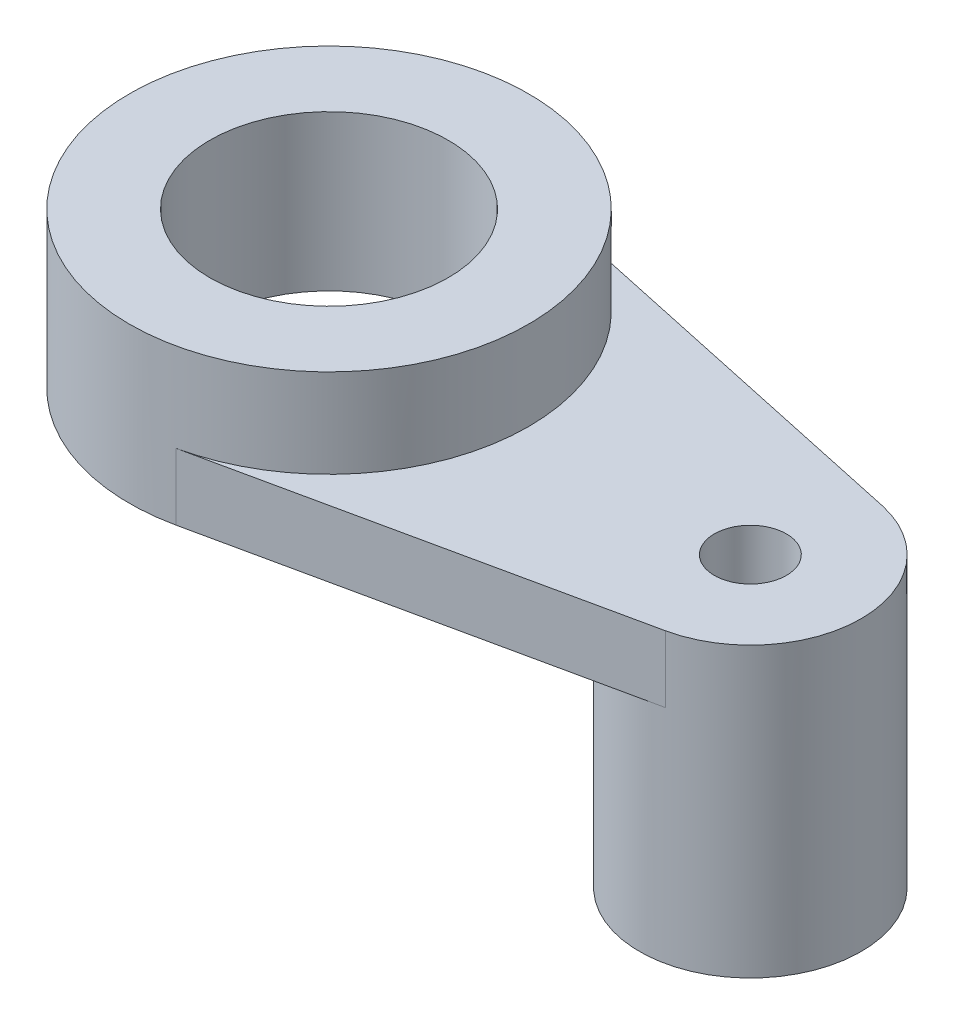
ISO-10303-21;
HEADER;
FILE_DESCRIPTION(('STEP AP214'),'2;1');
FILE_NAME('part.step','',(''),(''),'','','');
FILE_SCHEMA(('AUTOMOTIVE_DESIGN { 1 0 10303 214 1 1 1 1 }'));
ENDSEC;
DATA;
#1=APPLICATION_CONTEXT('core data for automotive mechanical design processes');
#2=APPLICATION_PROTOCOL_DEFINITION('international standard','automotive_design',2000,#1);
#3=PRODUCT_CONTEXT('',#1,'mechanical');
#4=PRODUCT('Part','Part','',(#3));
#5=PRODUCT_RELATED_PRODUCT_CATEGORY('part','',(#4));
#6=PRODUCT_DEFINITION_FORMATION('','',#4);
#7=PRODUCT_DEFINITION_CONTEXT('part definition',#1,'design');
#8=PRODUCT_DEFINITION('design','',#6,#7);
#9=PRODUCT_DEFINITION_SHAPE('','',#8);
#10=(LENGTH_UNIT() NAMED_UNIT(*) SI_UNIT(.MILLI.,.METRE.));
#11=(NAMED_UNIT(*) PLANE_ANGLE_UNIT() SI_UNIT($,.RADIAN.));
#12=(NAMED_UNIT(*) SI_UNIT($,.STERADIAN.) SOLID_ANGLE_UNIT());
#13=UNCERTAINTY_MEASURE_WITH_UNIT(LENGTH_MEASURE(1.E-05),#10,'distance_accuracy_value','');
#14=(GEOMETRIC_REPRESENTATION_CONTEXT(3) GLOBAL_UNCERTAINTY_ASSIGNED_CONTEXT((#13)) GLOBAL_UNIT_ASSIGNED_CONTEXT((#10,
#11,#12)) REPRESENTATION_CONTEXT('',''));
#15=CARTESIAN_POINT('',(0.,0.,0.));
#16=DIRECTION('',(0.,0.,1.));
#17=DIRECTION('',(1.,0.,0.));
#18=AXIS2_PLACEMENT_3D('',#15,#16,#17);
#19=CARTESIAN_POINT('',(0.,14.,0.));
#20=DIRECTION('',(0.,-1.,0.));
#21=DIRECTION('',(0.,0.,-1.));
#22=AXIS2_PLACEMENT_3D('',#19,#20,#21);
#23=CYLINDRICAL_SURFACE('',#22,18.);
#24=DIRECTION('',(0.,-1.,0.));
#25=VECTOR('',#24,1.);
#26=CARTESIAN_POINT('',(3.78947368421053,6.,17.5965874304274));
#27=LINE('',#26,#25);
#28=CARTESIAN_POINT('',(3.78947368421052,6.,17.5965874304274));
#29=VERTEX_POINT('',#28);
#30=CARTESIAN_POINT('',(3.78947368421053,0.,17.5965874304274));
#31=VERTEX_POINT('',#30);
#32=EDGE_CURVE('E67',#29,#31,#27,.T.);
#33=ORIENTED_EDGE('',*,*,#32,.F.);
#34=CARTESIAN_POINT('',(0.,6.,0.));
#35=DIRECTION('',(0.,-1.,0.));
#36=DIRECTION('',(0.,0.,-1.));
#37=AXIS2_PLACEMENT_3D('',#34,#35,#36);
#38=CIRCLE('',#37,18.);
#39=CARTESIAN_POINT('',(3.78947368421053,6.,-17.5965874304274));
#40=VERTEX_POINT('',#39);
#41=EDGE_CURVE('E50',#40,#29,#38,.T.);
#42=ORIENTED_EDGE('',*,*,#41,.F.);
#43=DIRECTION('',(0.,-1.,0.));
#44=VECTOR('',#43,1.);
#45=CARTESIAN_POINT('',(3.78947368421053,6.,-17.5965874304274));
#46=LINE('',#45,#44);
#47=CARTESIAN_POINT('',(3.78947368421053,0.,-17.5965874304274));
#48=VERTEX_POINT('',#47);
#49=EDGE_CURVE('E125',#40,#48,#46,.T.);
#50=ORIENTED_EDGE('',*,*,#49,.T.);
#51=CARTESIAN_POINT('',(0.,0.,0.));
#52=DIRECTION('',(0.,1.,0.));
#53=DIRECTION('',(0.,0.,1.));
#54=AXIS2_PLACEMENT_3D('',#51,#52,#53);
#55=CIRCLE('',#54,18.);
#56=EDGE_CURVE('E91',#48,#31,#55,.T.);
#57=ORIENTED_EDGE('',*,*,#56,.T.);
#58=EDGE_LOOP('',(#33,#42,#50,#57));
#59=FACE_BOUND('',#58,.T.);
#60=CARTESIAN_POINT('',(0.,14.,0.));
#61=DIRECTION('',(0.,1.,0.));
#62=DIRECTION('',(0.,0.,1.));
#63=AXIS2_PLACEMENT_3D('',#60,#61,#62);
#64=CIRCLE('',#63,18.);
#65=CARTESIAN_POINT('',(0.,14.,18.));
#66=VERTEX_POINT('',#65);
#67=EDGE_CURVE('E130',#66,#66,#64,.T.);
#68=ORIENTED_EDGE('',*,*,#67,.F.);
#69=EDGE_LOOP('',(#68));
#70=FACE_BOUND('',#69,.T.);
#71=ADVANCED_FACE('F47',(#59,#70),#23,.T.);
#72=CARTESIAN_POINT('',(0.,14.,0.));
#73=DIRECTION('',(0.,1.,0.));
#74=DIRECTION('',(0.,0.,1.));
#75=AXIS2_PLACEMENT_3D('',#72,#73,#74);
#76=PLANE('',#75);
#77=CARTESIAN_POINT('',(0.,14.,0.));
#78=DIRECTION('',(0.,1.,0.));
#79=DIRECTION('',(0.,0.,1.));
#80=AXIS2_PLACEMENT_3D('',#77,#78,#79);
#81=CIRCLE('',#80,10.75);
#82=CARTESIAN_POINT('',(0.,14.,10.75));
#83=VERTEX_POINT('',#82);
#84=EDGE_CURVE('E164',#83,#83,#81,.T.);
#85=ORIENTED_EDGE('',*,*,#84,.F.);
#86=EDGE_LOOP('',(#85));
#87=FACE_BOUND('',#86,.T.);
#88=ORIENTED_EDGE('',*,*,#67,.T.);
#89=EDGE_LOOP('',(#88));
#90=FACE_BOUND('',#89,.T.);
#91=ADVANCED_FACE('F174',(#87,#90),#76,.T.);
#92=CARTESIAN_POINT('',(0.,0.,0.));
#93=DIRECTION('',(0.,1.,0.));
#94=DIRECTION('',(0.,0.,1.));
#95=AXIS2_PLACEMENT_3D('',#92,#93,#94);
#96=PLANE('',#95);
#97=CARTESIAN_POINT('',(0.,0.,0.));
#98=DIRECTION('',(0.,1.,0.));
#99=DIRECTION('',(0.,0.,1.));
#100=AXIS2_PLACEMENT_3D('',#97,#98,#99);
#101=CIRCLE('',#100,10.75);
#102=CARTESIAN_POINT('',(0.,0.,10.75));
#103=VERTEX_POINT('',#102);
#104=EDGE_CURVE('E157',#103,#103,#101,.F.);
#105=ORIENTED_EDGE('',*,*,#104,.F.);
#106=EDGE_LOOP('',(#105));
#107=FACE_BOUND('',#106,.T.);
#108=CARTESIAN_POINT('',(38.,0.,0.));
#109=DIRECTION('',(0.,-1.,0.));
#110=DIRECTION('',(0.,0.,-1.));
#111=AXIS2_PLACEMENT_3D('',#108,#109,#110);
#112=CIRCLE('',#111,10.);
#113=CARTESIAN_POINT('',(40.1052631578947,0.,9.77588190579301));
#114=VERTEX_POINT('',#113);
#115=CARTESIAN_POINT('',(40.1052631578947,0.,-9.77588190579301));
#116=VERTEX_POINT('',#115);
#117=EDGE_CURVE('E11',#114,#116,#112,.T.);
#118=ORIENTED_EDGE('',*,*,#117,.F.);
#119=DIRECTION('',(0.977588190579301,0.,-0.210526315789474));
#120=VECTOR('',#119,1.);
#121=CARTESIAN_POINT('',(3.78947368421053,0.,17.5965874304274));
#122=LINE('',#121,#120);
#123=EDGE_CURVE('E94',#31,#114,#122,.T.);
#124=ORIENTED_EDGE('',*,*,#123,.F.);
#125=ORIENTED_EDGE('',*,*,#56,.F.);
#126=DIRECTION('',(0.977588190579301,0.,0.210526315789474));
#127=VECTOR('',#126,1.);
#128=CARTESIAN_POINT('',(3.78947368421053,0.,-17.5965874304274));
#129=LINE('',#128,#127);
#130=EDGE_CURVE('E86',#48,#116,#129,.T.);
#131=ORIENTED_EDGE('',*,*,#130,.T.);
#132=EDGE_LOOP('',(#118,#124,#125,#131));
#133=FACE_BOUND('',#132,.T.);
#134=ADVANCED_FACE('F88',(#107,#133),#96,.F.);
#135=CARTESIAN_POINT('',(0.,6.,0.));
#136=DIRECTION('',(0.,-1.,0.));
#137=DIRECTION('',(0.,0.,-1.));
#138=AXIS2_PLACEMENT_3D('',#135,#136,#137);
#139=PLANE('',#138);
#140=CARTESIAN_POINT('',(38.,6.,0.));
#141=DIRECTION('',(0.,-1.,0.));
#142=DIRECTION('',(0.,0.,-1.));
#143=AXIS2_PLACEMENT_3D('',#140,#141,#142);
#144=CIRCLE('',#143,3.24999999999999);
#145=CARTESIAN_POINT('',(38.,6.,-3.24999999999999));
#146=VERTEX_POINT('',#145);
#147=EDGE_CURVE('E107',#146,#146,#144,.T.);
#148=ORIENTED_EDGE('',*,*,#147,.T.);
#149=EDGE_LOOP('',(#148));
#150=FACE_BOUND('',#149,.T.);
#151=DIRECTION('',(0.977588190579301,0.,0.210526315789474));
#152=VECTOR('',#151,1.);
#153=CARTESIAN_POINT('',(3.78947368421053,6.,-17.5965874304274));
#154=LINE('',#153,#152);
#155=CARTESIAN_POINT('',(40.1052631578947,6.,-9.77588190579301));
#156=VERTEX_POINT('',#155);
#157=EDGE_CURVE('E101',#40,#156,#154,.T.);
#158=ORIENTED_EDGE('',*,*,#157,.F.);
#159=ORIENTED_EDGE('',*,*,#41,.T.);
#160=DIRECTION('',(0.977588190579301,0.,-0.210526315789474));
#161=VECTOR('',#160,1.);
#162=CARTESIAN_POINT('',(3.78947368421053,6.,17.5965874304274));
#163=LINE('',#162,#161);
#164=CARTESIAN_POINT('',(40.1052631578947,6.,9.77588190579301));
#165=VERTEX_POINT('',#164);
#166=EDGE_CURVE('E137',#29,#165,#163,.T.);
#167=ORIENTED_EDGE('',*,*,#166,.T.);
#168=CARTESIAN_POINT('',(38.,6.,0.));
#169=DIRECTION('',(0.,-1.,0.));
#170=DIRECTION('',(0.,0.,-1.));
#171=AXIS2_PLACEMENT_3D('',#168,#169,#170);
#172=CIRCLE('',#171,10.);
#173=EDGE_CURVE('E113',#156,#165,#172,.T.);
#174=ORIENTED_EDGE('',*,*,#173,.F.);
#175=EDGE_LOOP('',(#158,#159,#167,#174));
#176=FACE_BOUND('',#175,.T.);
#177=ADVANCED_FACE('F136',(#150,#176),#139,.F.);
#178=CARTESIAN_POINT('',(3.78947368421053,6.,-17.5965874304274));
#179=DIRECTION('',(0.210526315789474,0.,-0.977588190579301));
#180=DIRECTION('',(-0.977588190579301,0.,-0.210526315789474));
#181=AXIS2_PLACEMENT_3D('',#178,#179,#180);
#182=PLANE('',#181);
#183=ORIENTED_EDGE('',*,*,#130,.F.);
#184=ORIENTED_EDGE('',*,*,#49,.F.);
#185=ORIENTED_EDGE('',*,*,#157,.T.);
#186=DIRECTION('',(0.,-1.,0.));
#187=VECTOR('',#186,1.);
#188=CARTESIAN_POINT('',(40.1052631578947,6.,-9.77588190579301));
#189=LINE('',#188,#187);
#190=EDGE_CURVE('E98',#156,#116,#189,.T.);
#191=ORIENTED_EDGE('',*,*,#190,.T.);
#192=EDGE_LOOP('',(#183,#184,#185,#191));
#193=FACE_BOUND('',#192,.T.);
#194=ADVANCED_FACE('F99',(#193),#182,.T.);
#195=CARTESIAN_POINT('',(3.78947368421053,6.,17.5965874304274));
#196=DIRECTION('',(-0.210526315789474,0.,-0.977588190579301));
#197=DIRECTION('',(-0.977588190579301,0.,0.210526315789474));
#198=AXIS2_PLACEMENT_3D('',#195,#196,#197);
#199=PLANE('',#198);
#200=ORIENTED_EDGE('',*,*,#123,.T.);
#201=DIRECTION('',(0.,-1.,0.));
#202=VECTOR('',#201,1.);
#203=CARTESIAN_POINT('',(40.1052631578947,6.,9.77588190579301));
#204=LINE('',#203,#202);
#205=EDGE_CURVE('E106',#165,#114,#204,.T.);
#206=ORIENTED_EDGE('',*,*,#205,.F.);
#207=ORIENTED_EDGE('',*,*,#166,.F.);
#208=ORIENTED_EDGE('',*,*,#32,.T.);
#209=EDGE_LOOP('',(#200,#206,#207,#208));
#210=FACE_BOUND('',#209,.T.);
#211=ADVANCED_FACE('F118',(#210),#199,.F.);
#212=CARTESIAN_POINT('',(38.,6.,0.));
#213=DIRECTION('',(0.,-1.,0.));
#214=DIRECTION('',(0.,0.,-1.));
#215=AXIS2_PLACEMENT_3D('',#212,#213,#214);
#216=CYLINDRICAL_SURFACE('',#215,10.);
#217=ORIENTED_EDGE('',*,*,#205,.T.);
#218=ORIENTED_EDGE('',*,*,#117,.T.);
#219=ORIENTED_EDGE('',*,*,#190,.F.);
#220=ORIENTED_EDGE('',*,*,#173,.T.);
#221=EDGE_LOOP('',(#217,#218,#219,#220));
#222=FACE_BOUND('',#221,.T.);
#223=CARTESIAN_POINT('',(38.,-20.,0.));
#224=DIRECTION('',(0.,-1.,0.));
#225=DIRECTION('',(0.,0.,-1.));
#226=AXIS2_PLACEMENT_3D('',#223,#224,#225);
#227=CIRCLE('',#226,10.);
#228=CARTESIAN_POINT('',(38.,-20.,-10.));
#229=VERTEX_POINT('',#228);
#230=EDGE_CURVE('E95',#229,#229,#227,.T.);
#231=ORIENTED_EDGE('',*,*,#230,.F.);
#232=EDGE_LOOP('',(#231));
#233=FACE_BOUND('',#232,.T.);
#234=ADVANCED_FACE('F109',(#222,#233),#216,.T.);
#235=CARTESIAN_POINT('',(38.,6.,0.));
#236=DIRECTION('',(0.,-1.,0.));
#237=DIRECTION('',(0.,0.,-1.));
#238=AXIS2_PLACEMENT_3D('',#235,#236,#237);
#239=CYLINDRICAL_SURFACE('',#238,3.24999999999999);
#240=ORIENTED_EDGE('',*,*,#147,.F.);
#241=EDGE_LOOP('',(#240));
#242=FACE_BOUND('',#241,.T.);
#243=CARTESIAN_POINT('',(38.,-20.,0.));
#244=DIRECTION('',(0.,-1.,0.));
#245=DIRECTION('',(0.,0.,-1.));
#246=AXIS2_PLACEMENT_3D('',#243,#244,#245);
#247=CIRCLE('',#246,3.24999999999999);
#248=CARTESIAN_POINT('',(38.,-20.,-3.24999999999999));
#249=VERTEX_POINT('',#248);
#250=EDGE_CURVE('E154',#249,#249,#247,.T.);
#251=ORIENTED_EDGE('',*,*,#250,.T.);
#252=EDGE_LOOP('',(#251));
#253=FACE_BOUND('',#252,.T.);
#254=ADVANCED_FACE('F147',(#242,#253),#239,.F.);
#255=CARTESIAN_POINT('',(38.,-20.,0.));
#256=DIRECTION('',(0.,-1.,0.));
#257=DIRECTION('',(0.,0.,-1.));
#258=AXIS2_PLACEMENT_3D('',#255,#256,#257);
#259=PLANE('',#258);
#260=ORIENTED_EDGE('',*,*,#230,.T.);
#261=EDGE_LOOP('',(#260));
#262=FACE_BOUND('',#261,.T.);
#263=ORIENTED_EDGE('',*,*,#250,.F.);
#264=EDGE_LOOP('',(#263));
#265=FACE_BOUND('',#264,.T.);
#266=ADVANCED_FACE('F150',(#262,#265),#259,.T.);
#267=CARTESIAN_POINT('',(0.,-20.001,0.));
#268=DIRECTION('',(0.,1.,0.));
#269=DIRECTION('',(0.,0.,1.));
#270=AXIS2_PLACEMENT_3D('',#267,#268,#269);
#271=CYLINDRICAL_SURFACE('',#270,10.75);
#272=ORIENTED_EDGE('',*,*,#84,.T.);
#273=EDGE_LOOP('',(#272));
#274=FACE_BOUND('',#273,.T.);
#275=ORIENTED_EDGE('',*,*,#104,.T.);
#276=EDGE_LOOP('',(#275));
#277=FACE_BOUND('',#276,.T.);
#278=ADVANCED_FACE('F171',(#274,#277),#271,.F.);
#279=CLOSED_SHELL('',(#71,#91,#134,#177,#194,#211,#234,#254,#266,#278));
#280=MANIFOLD_SOLID_BREP('B2',#279);
#281=ADVANCED_BREP_SHAPE_REPRESENTATION('',(#18,#280),#14);
#282=SHAPE_DEFINITION_REPRESENTATION(#9,#281);
ENDSEC;
END-ISO-10303-21;
